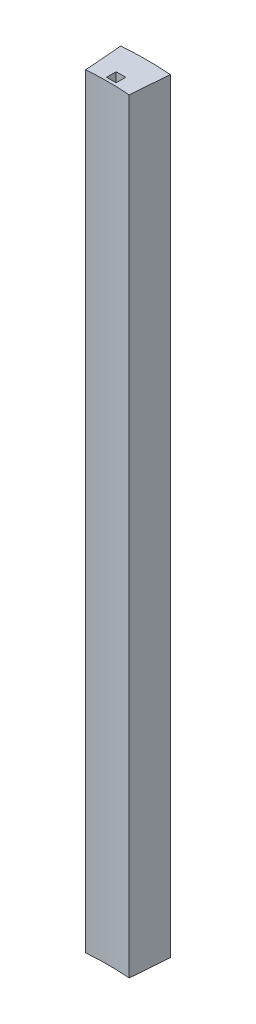
ISO-10303-21;
HEADER;
FILE_DESCRIPTION(('STEP AP214'),'2;1');
FILE_NAME('part.step','',(''),(''),'','','');
FILE_SCHEMA(('AUTOMOTIVE_DESIGN { 1 0 10303 214 1 1 1 1 }'));
ENDSEC;
DATA;
#1=APPLICATION_CONTEXT('core data for automotive mechanical design processes');
#2=APPLICATION_PROTOCOL_DEFINITION('international standard','automotive_design',2000,#1);
#3=PRODUCT_CONTEXT('',#1,'mechanical');
#4=PRODUCT('Part','Part','',(#3));
#5=PRODUCT_RELATED_PRODUCT_CATEGORY('part','',(#4));
#6=PRODUCT_DEFINITION_FORMATION('','',#4);
#7=PRODUCT_DEFINITION_CONTEXT('part definition',#1,'design');
#8=PRODUCT_DEFINITION('design','',#6,#7);
#9=PRODUCT_DEFINITION_SHAPE('','',#8);
#10=(LENGTH_UNIT() NAMED_UNIT(*) SI_UNIT(.MILLI.,.METRE.));
#11=(NAMED_UNIT(*) PLANE_ANGLE_UNIT() SI_UNIT($,.RADIAN.));
#12=(NAMED_UNIT(*) SI_UNIT($,.STERADIAN.) SOLID_ANGLE_UNIT());
#13=UNCERTAINTY_MEASURE_WITH_UNIT(LENGTH_MEASURE(1.E-05),#10,'distance_accuracy_value','');
#14=(GEOMETRIC_REPRESENTATION_CONTEXT(3) GLOBAL_UNCERTAINTY_ASSIGNED_CONTEXT((#13)) GLOBAL_UNIT_ASSIGNED_CONTEXT((#10,
#11,#12)) REPRESENTATION_CONTEXT('',''));
#15=CARTESIAN_POINT('',(0.,0.,0.));
#16=DIRECTION('',(0.,0.,1.));
#17=DIRECTION('',(1.,0.,0.));
#18=AXIS2_PLACEMENT_3D('',#15,#16,#17);
#19=CARTESIAN_POINT('',(0.,127.,0.));
#20=DIRECTION('',(0.,1.,0.));
#21=DIRECTION('',(0.,0.,1.));
#22=AXIS2_PLACEMENT_3D('',#19,#20,#21);
#23=PLANE('',#22);
#24=CARTESIAN_POINT('',(0.,127.,0.));
#25=DIRECTION('',(0.,1.,0.));
#26=DIRECTION('',(0.,0.,1.));
#27=AXIS2_PLACEMENT_3D('',#24,#25,#26);
#28=CIRCLE('',#27,52.3875);
#29=CARTESIAN_POINT('',(4.11027587744232,127.,-52.2260068209443));
#30=VERTEX_POINT('',#29);
#31=CARTESIAN_POINT('',(-4.11027587744233,127.,-52.2260068209443));
#32=VERTEX_POINT('',#31);
#33=EDGE_CURVE('E153',#30,#32,#28,.T.);
#34=ORIENTED_EDGE('',*,*,#33,.T.);
#35=DIRECTION('',(0.078459095727842,0.,0.996917333733128));
#36=VECTOR('',#35,1.);
#37=CARTESIAN_POINT('',(-4.11027587744233,127.,-52.2260068209443));
#38=LINE('',#37,#36);
#39=CARTESIAN_POINT('',(-3.61206061957051,127.,-45.8955817517389));
#40=VERTEX_POINT('',#39);
#41=EDGE_CURVE('E157',#32,#40,#38,.T.);
#42=ORIENTED_EDGE('',*,*,#41,.T.);
#43=CARTESIAN_POINT('',(0.,127.,0.));
#44=DIRECTION('',(0.,-1.,0.));
#45=DIRECTION('',(0.,0.,1.));
#46=AXIS2_PLACEMENT_3D('',#43,#44,#45);
#47=CIRCLE('',#46,46.0375);
#48=CARTESIAN_POINT('',(3.61206061957052,127.,-45.8955817517389));
#49=VERTEX_POINT('',#48);
#50=EDGE_CURVE('E161',#40,#49,#47,.T.);
#51=ORIENTED_EDGE('',*,*,#50,.T.);
#52=DIRECTION('',(0.0784590957278433,0.,-0.996917333733128));
#53=VECTOR('',#52,1.);
#54=CARTESIAN_POINT('',(4.11027587744232,127.,-52.2260068209443));
#55=LINE('',#54,#53);
#56=EDGE_CURVE('E164',#49,#30,#55,.T.);
#57=ORIENTED_EDGE('',*,*,#56,.T.);
#58=EDGE_LOOP('',(#34,#42,#51,#57));
#59=FACE_BOUND('',#58,.T.);
#60=DIRECTION('',(0.,0.,1.));
#61=VECTOR('',#60,1.);
#62=CARTESIAN_POINT('',(-0.793750000000006,127.,-48.133));
#63=LINE('',#62,#61);
#64=CARTESIAN_POINT('',(-0.793750000000006,127.,-48.133));
#65=VERTEX_POINT('',#64);
#66=CARTESIAN_POINT('',(-0.793749999999994,127.,-46.5455));
#67=VERTEX_POINT('',#66);
#68=EDGE_CURVE('E114',#65,#67,#63,.T.);
#69=ORIENTED_EDGE('',*,*,#68,.F.);
#70=DIRECTION('',(-1.,0.,0.));
#71=VECTOR('',#70,1.);
#72=CARTESIAN_POINT('',(0.793749999999994,127.,-48.133));
#73=LINE('',#72,#71);
#74=CARTESIAN_POINT('',(0.793749999999994,127.,-48.133));
#75=VERTEX_POINT('',#74);
#76=EDGE_CURVE('E105',#75,#65,#73,.T.);
#77=ORIENTED_EDGE('',*,*,#76,.F.);
#78=DIRECTION('',(0.,0.,-1.));
#79=VECTOR('',#78,1.);
#80=CARTESIAN_POINT('',(0.793749999999994,127.,-46.5455));
#81=LINE('',#80,#79);
#82=CARTESIAN_POINT('',(0.793749999999994,127.,-46.5455));
#83=VERTEX_POINT('',#82);
#84=EDGE_CURVE('E131',#83,#75,#81,.T.);
#85=ORIENTED_EDGE('',*,*,#84,.F.);
#86=DIRECTION('',(1.,0.,0.));
#87=VECTOR('',#86,1.);
#88=CARTESIAN_POINT('',(-0.793749999999994,127.,-46.5455));
#89=LINE('',#88,#87);
#90=EDGE_CURVE('E127',#67,#83,#89,.T.);
#91=ORIENTED_EDGE('',*,*,#90,.F.);
#92=EDGE_LOOP('',(#69,#77,#85,#91));
#93=FACE_BOUND('',#92,.T.);
#94=ADVANCED_FACE('F39',(#59,#93),#23,.T.);
#95=CARTESIAN_POINT('',(0.,0.,0.));
#96=DIRECTION('',(0.,1.,0.));
#97=DIRECTION('',(0.,0.,1.));
#98=AXIS2_PLACEMENT_3D('',#95,#96,#97);
#99=PLANE('',#98);
#100=CARTESIAN_POINT('',(0.,0.,0.));
#101=DIRECTION('',(0.,1.,0.));
#102=DIRECTION('',(0.,0.,1.));
#103=AXIS2_PLACEMENT_3D('',#100,#101,#102);
#104=CIRCLE('',#103,52.3875);
#105=CARTESIAN_POINT('',(4.11027587744232,0.,-52.2260068209443));
#106=VERTEX_POINT('',#105);
#107=CARTESIAN_POINT('',(-4.11027587744233,0.,-52.2260068209443));
#108=VERTEX_POINT('',#107);
#109=EDGE_CURVE('E123',#106,#108,#104,.T.);
#110=ORIENTED_EDGE('',*,*,#109,.F.);
#111=DIRECTION('',(0.0784590957278433,0.,-0.996917333733128));
#112=VECTOR('',#111,1.);
#113=CARTESIAN_POINT('',(4.11027587744232,0.,-52.2260068209443));
#114=LINE('',#113,#112);
#115=CARTESIAN_POINT('',(3.61206061957052,0.,-45.8955817517389));
#116=VERTEX_POINT('',#115);
#117=EDGE_CURVE('E158',#116,#106,#114,.T.);
#118=ORIENTED_EDGE('',*,*,#117,.F.);
#119=CARTESIAN_POINT('',(0.,0.,0.));
#120=DIRECTION('',(0.,-1.,0.));
#121=DIRECTION('',(0.,0.,1.));
#122=AXIS2_PLACEMENT_3D('',#119,#120,#121);
#123=CIRCLE('',#122,46.0375);
#124=CARTESIAN_POINT('',(-3.61206061957051,0.,-45.8955817517389));
#125=VERTEX_POINT('',#124);
#126=EDGE_CURVE('E174',#125,#116,#123,.T.);
#127=ORIENTED_EDGE('',*,*,#126,.F.);
#128=DIRECTION('',(0.078459095727842,0.,0.996917333733128));
#129=VECTOR('',#128,1.);
#130=CARTESIAN_POINT('',(-4.11027587744233,0.,-52.2260068209443));
#131=LINE('',#130,#129);
#132=EDGE_CURVE('E171',#108,#125,#131,.T.);
#133=ORIENTED_EDGE('',*,*,#132,.F.);
#134=EDGE_LOOP('',(#110,#118,#127,#133));
#135=FACE_BOUND('',#134,.T.);
#136=DIRECTION('',(-1.,0.,0.));
#137=VECTOR('',#136,1.);
#138=CARTESIAN_POINT('',(0.793749999999994,0.,-48.133));
#139=LINE('',#138,#137);
#140=CARTESIAN_POINT('',(0.793749999999994,0.,-48.133));
#141=VERTEX_POINT('',#140);
#142=CARTESIAN_POINT('',(-0.793750000000006,0.,-48.133));
#143=VERTEX_POINT('',#142);
#144=EDGE_CURVE('E63',#141,#143,#139,.T.);
#145=ORIENTED_EDGE('',*,*,#144,.T.);
#146=DIRECTION('',(0.,0.,1.));
#147=VECTOR('',#146,1.);
#148=CARTESIAN_POINT('',(-0.793750000000006,0.,-48.133));
#149=LINE('',#148,#147);
#150=CARTESIAN_POINT('',(-0.793749999999994,0.,-46.5455));
#151=VERTEX_POINT('',#150);
#152=EDGE_CURVE('E121',#143,#151,#149,.T.);
#153=ORIENTED_EDGE('',*,*,#152,.T.);
#154=DIRECTION('',(1.,0.,0.));
#155=VECTOR('',#154,1.);
#156=CARTESIAN_POINT('',(-0.793749999999994,0.,-46.5455));
#157=LINE('',#156,#155);
#158=CARTESIAN_POINT('',(0.793749999999994,0.,-46.5455));
#159=VERTEX_POINT('',#158);
#160=EDGE_CURVE('E140',#151,#159,#157,.T.);
#161=ORIENTED_EDGE('',*,*,#160,.T.);
#162=DIRECTION('',(0.,0.,-1.));
#163=VECTOR('',#162,1.);
#164=CARTESIAN_POINT('',(0.793749999999994,0.,-46.5455));
#165=LINE('',#164,#163);
#166=EDGE_CURVE('E115',#159,#141,#165,.T.);
#167=ORIENTED_EDGE('',*,*,#166,.T.);
#168=EDGE_LOOP('',(#145,#153,#161,#167));
#169=FACE_BOUND('',#168,.T.);
#170=ADVANCED_FACE('F197',(#135,#169),#99,.F.);
#171=CARTESIAN_POINT('',(0.,127.,0.));
#172=DIRECTION('',(0.,-1.,0.));
#173=DIRECTION('',(0.,0.,-1.));
#174=AXIS2_PLACEMENT_3D('',#171,#172,#173);
#175=CYLINDRICAL_SURFACE('',#174,52.3875);
#176=ORIENTED_EDGE('',*,*,#109,.T.);
#177=DIRECTION('',(0.,-1.,0.));
#178=VECTOR('',#177,1.);
#179=CARTESIAN_POINT('',(-4.11027587744233,127.,-52.2260068209443));
#180=LINE('',#179,#178);
#181=EDGE_CURVE('E11',#32,#108,#180,.T.);
#182=ORIENTED_EDGE('',*,*,#181,.F.);
#183=ORIENTED_EDGE('',*,*,#33,.F.);
#184=DIRECTION('',(0.,-1.,0.));
#185=VECTOR('',#184,1.);
#186=CARTESIAN_POINT('',(4.11027587744232,127.,-52.2260068209443));
#187=LINE('',#186,#185);
#188=EDGE_CURVE('E167',#30,#106,#187,.T.);
#189=ORIENTED_EDGE('',*,*,#188,.T.);
#190=EDGE_LOOP('',(#176,#182,#183,#189));
#191=FACE_BOUND('',#190,.T.);
#192=ADVANCED_FACE('F41',(#191),#175,.T.);
#193=CARTESIAN_POINT('',(-4.11027587744233,127.,-52.2260068209443));
#194=DIRECTION('',(0.996917333733128,0.,-0.078459095727842));
#195=DIRECTION('',(-0.078459095727842,0.,-0.996917333733128));
#196=AXIS2_PLACEMENT_3D('',#193,#194,#195);
#197=PLANE('',#196);
#198=ORIENTED_EDGE('',*,*,#132,.T.);
#199=DIRECTION('',(0.,-1.,0.));
#200=VECTOR('',#199,1.);
#201=CARTESIAN_POINT('',(-3.61206061957051,127.,-45.8955817517389));
#202=LINE('',#201,#200);
#203=EDGE_CURVE('E48',#40,#125,#202,.T.);
#204=ORIENTED_EDGE('',*,*,#203,.F.);
#205=ORIENTED_EDGE('',*,*,#41,.F.);
#206=ORIENTED_EDGE('',*,*,#181,.T.);
#207=EDGE_LOOP('',(#198,#204,#205,#206));
#208=FACE_BOUND('',#207,.T.);
#209=ADVANCED_FACE('F207',(#208),#197,.F.);
#210=CARTESIAN_POINT('',(0.,127.,0.));
#211=DIRECTION('',(0.,-1.,0.));
#212=DIRECTION('',(0.,0.,-1.));
#213=AXIS2_PLACEMENT_3D('',#210,#211,#212);
#214=CYLINDRICAL_SURFACE('',#213,46.0375);
#215=ORIENTED_EDGE('',*,*,#126,.T.);
#216=DIRECTION('',(0.,-1.,0.));
#217=VECTOR('',#216,1.);
#218=CARTESIAN_POINT('',(3.61206061957052,127.,-45.8955817517389));
#219=LINE('',#218,#217);
#220=EDGE_CURVE('E182',#49,#116,#219,.T.);
#221=ORIENTED_EDGE('',*,*,#220,.F.);
#222=ORIENTED_EDGE('',*,*,#50,.F.);
#223=ORIENTED_EDGE('',*,*,#203,.T.);
#224=EDGE_LOOP('',(#215,#221,#222,#223));
#225=FACE_BOUND('',#224,.T.);
#226=ADVANCED_FACE('F191',(#225),#214,.F.);
#227=CARTESIAN_POINT('',(4.11027587744232,127.,-52.2260068209443));
#228=DIRECTION('',(-0.996917333733128,0.,-0.0784590957278433));
#229=DIRECTION('',(-0.0784590957278433,0.,0.996917333733128));
#230=AXIS2_PLACEMENT_3D('',#227,#228,#229);
#231=PLANE('',#230);
#232=ORIENTED_EDGE('',*,*,#117,.T.);
#233=ORIENTED_EDGE('',*,*,#188,.F.);
#234=ORIENTED_EDGE('',*,*,#56,.F.);
#235=ORIENTED_EDGE('',*,*,#220,.T.);
#236=EDGE_LOOP('',(#232,#233,#234,#235));
#237=FACE_BOUND('',#236,.T.);
#238=ADVANCED_FACE('F201',(#237),#231,.F.);
#239=CARTESIAN_POINT('',(0.793749999999994,127.,-48.133));
#240=DIRECTION('',(0.,0.,1.));
#241=DIRECTION('',(1.,0.,0.));
#242=AXIS2_PLACEMENT_3D('',#239,#240,#241);
#243=PLANE('',#242);
#244=ORIENTED_EDGE('',*,*,#144,.F.);
#245=DIRECTION('',(0.,-1.,0.));
#246=VECTOR('',#245,1.);
#247=CARTESIAN_POINT('',(0.793749999999994,127.,-48.133));
#248=LINE('',#247,#246);
#249=EDGE_CURVE('E109',#75,#141,#248,.T.);
#250=ORIENTED_EDGE('',*,*,#249,.F.);
#251=ORIENTED_EDGE('',*,*,#76,.T.);
#252=DIRECTION('',(0.,-1.,0.));
#253=VECTOR('',#252,1.);
#254=CARTESIAN_POINT('',(-0.793750000000006,127.,-48.133));
#255=LINE('',#254,#253);
#256=EDGE_CURVE('E108',#65,#143,#255,.T.);
#257=ORIENTED_EDGE('',*,*,#256,.T.);
#258=EDGE_LOOP('',(#244,#250,#251,#257));
#259=FACE_BOUND('',#258,.T.);
#260=ADVANCED_FACE('F107',(#259),#243,.T.);
#261=CARTESIAN_POINT('',(-0.793750000000006,127.,-48.133));
#262=DIRECTION('',(1.,0.,0.));
#263=DIRECTION('',(0.,0.,-1.));
#264=AXIS2_PLACEMENT_3D('',#261,#262,#263);
#265=PLANE('',#264);
#266=ORIENTED_EDGE('',*,*,#152,.F.);
#267=ORIENTED_EDGE('',*,*,#256,.F.);
#268=ORIENTED_EDGE('',*,*,#68,.T.);
#269=DIRECTION('',(0.,-1.,0.));
#270=VECTOR('',#269,1.);
#271=CARTESIAN_POINT('',(-0.793749999999994,127.,-46.5455));
#272=LINE('',#271,#270);
#273=EDGE_CURVE('E124',#67,#151,#272,.T.);
#274=ORIENTED_EDGE('',*,*,#273,.T.);
#275=EDGE_LOOP('',(#266,#267,#268,#274));
#276=FACE_BOUND('',#275,.T.);
#277=ADVANCED_FACE('F118',(#276),#265,.T.);
#278=CARTESIAN_POINT('',(-0.793749999999994,127.,-46.5455));
#279=DIRECTION('',(0.,0.,-1.));
#280=DIRECTION('',(-1.,0.,0.));
#281=AXIS2_PLACEMENT_3D('',#278,#279,#280);
#282=PLANE('',#281);
#283=ORIENTED_EDGE('',*,*,#160,.F.);
#284=ORIENTED_EDGE('',*,*,#273,.F.);
#285=ORIENTED_EDGE('',*,*,#90,.T.);
#286=DIRECTION('',(0.,-1.,0.));
#287=VECTOR('',#286,1.);
#288=CARTESIAN_POINT('',(0.793749999999994,127.,-46.5455));
#289=LINE('',#288,#287);
#290=EDGE_CURVE('E55',#83,#159,#289,.T.);
#291=ORIENTED_EDGE('',*,*,#290,.T.);
#292=EDGE_LOOP('',(#283,#284,#285,#291));
#293=FACE_BOUND('',#292,.T.);
#294=ADVANCED_FACE('F230',(#293),#282,.T.);
#295=CARTESIAN_POINT('',(0.793749999999994,127.,-46.5455));
#296=DIRECTION('',(-1.,0.,0.));
#297=DIRECTION('',(0.,0.,1.));
#298=AXIS2_PLACEMENT_3D('',#295,#296,#297);
#299=PLANE('',#298);
#300=ORIENTED_EDGE('',*,*,#166,.F.);
#301=ORIENTED_EDGE('',*,*,#290,.F.);
#302=ORIENTED_EDGE('',*,*,#84,.T.);
#303=ORIENTED_EDGE('',*,*,#249,.T.);
#304=EDGE_LOOP('',(#300,#301,#302,#303));
#305=FACE_BOUND('',#304,.T.);
#306=ADVANCED_FACE('F234',(#305),#299,.T.);
#307=CLOSED_SHELL('',(#94,#170,#192,#209,#226,#238,#260,#277,#294,#306));
#308=MANIFOLD_SOLID_BREP('B2',#307);
#309=ADVANCED_BREP_SHAPE_REPRESENTATION('',(#18,#308),#14);
#310=SHAPE_DEFINITION_REPRESENTATION(#9,#309);
ENDSEC;
END-ISO-10303-21;
